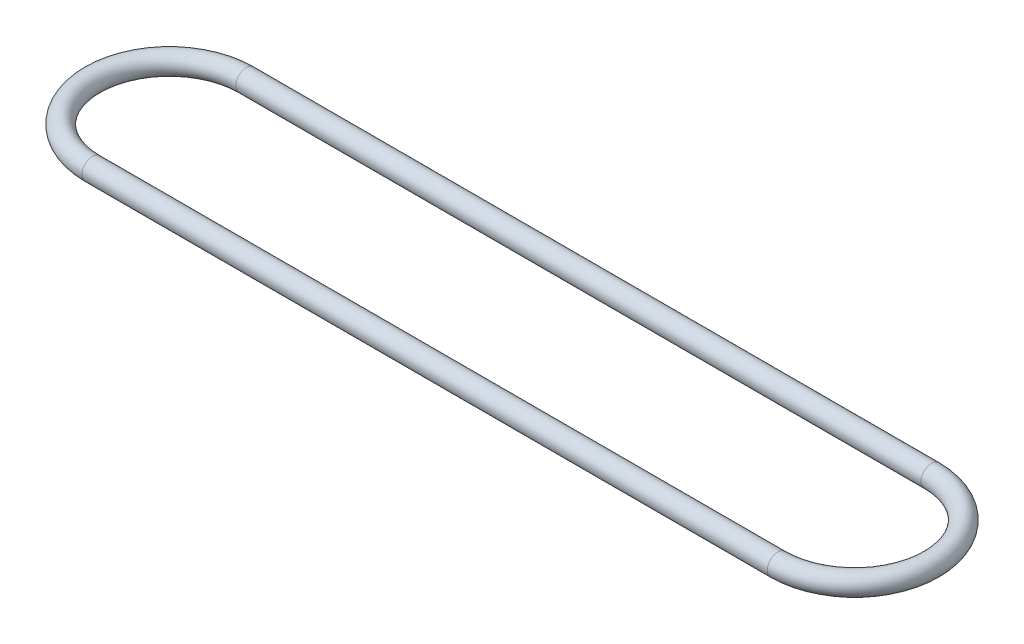
ISO-10303-21;
HEADER;
FILE_DESCRIPTION(('STEP AP214'),'2;1');
FILE_NAME('part.step','',(''),(''),'','','');
FILE_SCHEMA(('AUTOMOTIVE_DESIGN { 1 0 10303 214 1 1 1 1 }'));
ENDSEC;
DATA;
#1=APPLICATION_CONTEXT('core data for automotive mechanical design processes');
#2=APPLICATION_PROTOCOL_DEFINITION('international standard','automotive_design',2000,#1);
#3=PRODUCT_CONTEXT('',#1,'mechanical');
#4=PRODUCT('Part','Part','',(#3));
#5=PRODUCT_RELATED_PRODUCT_CATEGORY('part','',(#4));
#6=PRODUCT_DEFINITION_FORMATION('','',#4);
#7=PRODUCT_DEFINITION_CONTEXT('part definition',#1,'design');
#8=PRODUCT_DEFINITION('design','',#6,#7);
#9=PRODUCT_DEFINITION_SHAPE('','',#8);
#10=(LENGTH_UNIT() NAMED_UNIT(*) SI_UNIT(.MILLI.,.METRE.));
#11=(NAMED_UNIT(*) PLANE_ANGLE_UNIT() SI_UNIT($,.RADIAN.));
#12=(NAMED_UNIT(*) SI_UNIT($,.STERADIAN.) SOLID_ANGLE_UNIT());
#13=UNCERTAINTY_MEASURE_WITH_UNIT(LENGTH_MEASURE(1.E-05),#10,'distance_accuracy_value','');
#14=(GEOMETRIC_REPRESENTATION_CONTEXT(3) GLOBAL_UNCERTAINTY_ASSIGNED_CONTEXT((#13)) GLOBAL_UNIT_ASSIGNED_CONTEXT((#10,
#11,#12)) REPRESENTATION_CONTEXT('',''));
#15=CARTESIAN_POINT('',(0.,0.,0.));
#16=DIRECTION('',(0.,0.,1.));
#17=DIRECTION('',(1.,0.,0.));
#18=AXIS2_PLACEMENT_3D('',#15,#16,#17);
#19=CARTESIAN_POINT('',(0.,0.,0.));
#20=DIRECTION('',(0.,1.,0.));
#21=DIRECTION('',(0.,0.,1.));
#22=AXIS2_PLACEMENT_3D('',#19,#20,#21);
#23=TOROIDAL_SURFACE('',#22,25.58,3.5);
#24=CARTESIAN_POINT('',(0.,0.,-25.58));
#25=DIRECTION('',(1.,0.,0.));
#26=DIRECTION('',(0.,0.,-1.));
#27=AXIS2_PLACEMENT_3D('',#24,#25,#26);
#28=CIRCLE('',#27,3.5);
#29=CARTESIAN_POINT('',(0.,0.,-29.08));
#30=VERTEX_POINT('',#29);
#31=EDGE_CURVE('E59',#30,#30,#28,.T.);
#32=CARTESIAN_POINT('',(0.,0.,25.58));
#33=DIRECTION('',(-1.,0.,0.));
#34=DIRECTION('',(0.,0.,1.));
#35=AXIS2_PLACEMENT_3D('',#32,#33,#34);
#36=CIRCLE('',#35,3.5);
#37=CARTESIAN_POINT('',(0.,0.,29.08));
#38=VERTEX_POINT('',#37);
#39=EDGE_CURVE('E54',#38,#38,#36,.T.);
#40=CARTESIAN_POINT('',(0.,0.,0.));
#41=DIRECTION('',(0.,1.,0.));
#42=DIRECTION('',(0.,0.,1.));
#43=AXIS2_PLACEMENT_3D('',#40,#41,#42);
#44=CIRCLE('',#43,29.08);
#45=EDGE_CURVE('',#30,#38,#44,.T.);
#46=ORIENTED_EDGE('',*,*,#31,.F.);
#47=ORIENTED_EDGE('',*,*,#39,.T.);
#48=ORIENTED_EDGE('',*,*,#45,.T.);
#49=ORIENTED_EDGE('',*,*,#45,.F.);
#50=EDGE_LOOP('',(#46,#48,#47,#49));
#51=FACE_BOUND('',#50,.T.);
#52=ADVANCED_FACE('F41',(#51),#23,.T.);
#53=CARTESIAN_POINT('',(0.,0.,25.58));
#54=DIRECTION('',(1.,0.,0.));
#55=DIRECTION('',(0.,0.,-1.));
#56=AXIS2_PLACEMENT_3D('',#53,#54,#55);
#57=CYLINDRICAL_SURFACE('',#56,3.5);
#58=CARTESIAN_POINT('',(228.,0.,25.58));
#59=DIRECTION('',(-1.,0.,0.));
#60=DIRECTION('',(0.,0.,1.));
#61=AXIS2_PLACEMENT_3D('',#58,#59,#60);
#62=CIRCLE('',#61,3.5);
#63=CARTESIAN_POINT('',(228.,0.,29.08));
#64=VERTEX_POINT('',#63);
#65=EDGE_CURVE('E49',#64,#64,#62,.T.);
#66=ORIENTED_EDGE('',*,*,#65,.T.);
#67=EDGE_LOOP('',(#66));
#68=FACE_BOUND('',#67,.T.);
#69=ORIENTED_EDGE('',*,*,#39,.F.);
#70=EDGE_LOOP('',(#69));
#71=FACE_BOUND('',#70,.T.);
#72=ADVANCED_FACE('F69',(#68,#71),#57,.T.);
#73=CARTESIAN_POINT('',(228.,0.,0.));
#74=DIRECTION('',(0.,1.,0.));
#75=DIRECTION('',(0.,0.,1.));
#76=AXIS2_PLACEMENT_3D('',#73,#74,#75);
#77=TOROIDAL_SURFACE('',#76,25.58,3.5);
#78=CARTESIAN_POINT('',(228.,0.,-25.58));
#79=DIRECTION('',(1.,0.,0.));
#80=DIRECTION('',(0.,0.,-1.));
#81=AXIS2_PLACEMENT_3D('',#78,#79,#80);
#82=CIRCLE('',#81,3.5);
#83=CARTESIAN_POINT('',(228.,0.,-29.08));
#84=VERTEX_POINT('',#83);
#85=EDGE_CURVE('E10',#84,#84,#82,.T.);
#86=CARTESIAN_POINT('',(228.,0.,0.));
#87=DIRECTION('',(0.,1.,0.));
#88=DIRECTION('',(0.,0.,1.));
#89=AXIS2_PLACEMENT_3D('',#86,#87,#88);
#90=CIRCLE('',#89,29.08);
#91=EDGE_CURVE('',#64,#84,#90,.T.);
#92=ORIENTED_EDGE('',*,*,#65,.F.);
#93=ORIENTED_EDGE('',*,*,#85,.T.);
#94=ORIENTED_EDGE('',*,*,#91,.T.);
#95=ORIENTED_EDGE('',*,*,#91,.F.);
#96=EDGE_LOOP('',(#92,#94,#93,#95));
#97=FACE_BOUND('',#96,.T.);
#98=ADVANCED_FACE('F75',(#97),#77,.T.);
#99=CARTESIAN_POINT('',(228.,0.,-25.58));
#100=DIRECTION('',(-1.,0.,0.));
#101=DIRECTION('',(0.,0.,1.));
#102=AXIS2_PLACEMENT_3D('',#99,#100,#101);
#103=CYLINDRICAL_SURFACE('',#102,3.5);
#104=ORIENTED_EDGE('',*,*,#31,.T.);
#105=EDGE_LOOP('',(#104));
#106=FACE_BOUND('',#105,.T.);
#107=ORIENTED_EDGE('',*,*,#85,.F.);
#108=EDGE_LOOP('',(#107));
#109=FACE_BOUND('',#108,.T.);
#110=ADVANCED_FACE('F43',(#106,#109),#103,.T.);
#111=CLOSED_SHELL('',(#52,#72,#98,#110));
#112=MANIFOLD_SOLID_BREP('B2',#111);
#113=ADVANCED_BREP_SHAPE_REPRESENTATION('',(#18,#112),#14);
#114=SHAPE_DEFINITION_REPRESENTATION(#9,#113);
ENDSEC;
END-ISO-10303-21;
